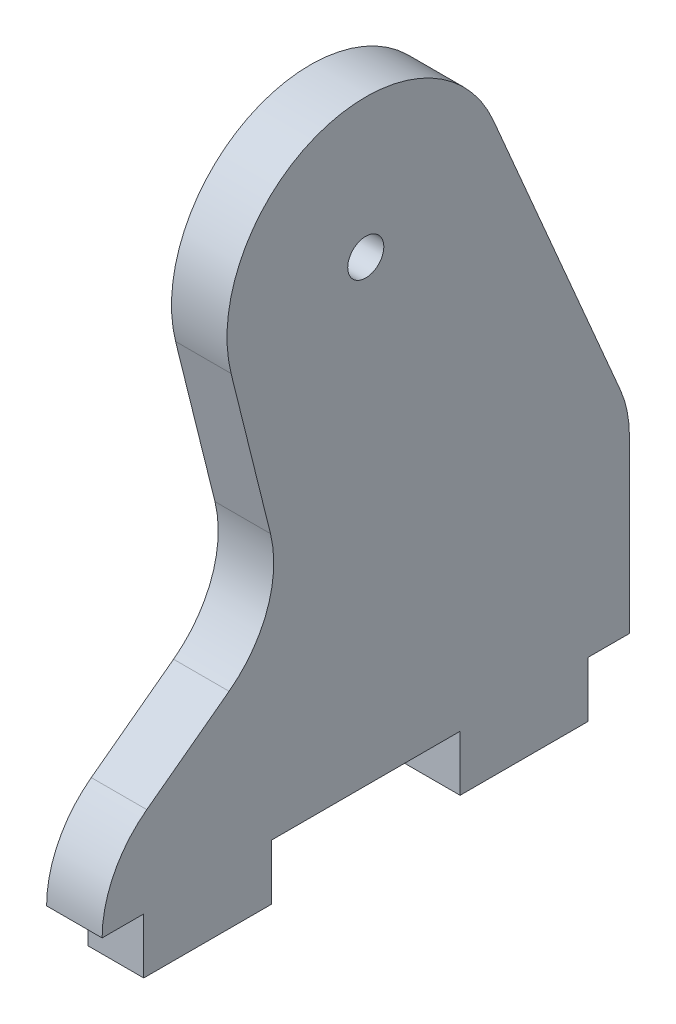
ISO-10303-21;
HEADER;
FILE_DESCRIPTION(('STEP AP214'),'2;1');
FILE_NAME('part.step','',(''),(''),'','','');
FILE_SCHEMA(('AUTOMOTIVE_DESIGN { 1 0 10303 214 1 1 1 1 }'));
ENDSEC;
DATA;
#1=APPLICATION_CONTEXT('core data for automotive mechanical design processes');
#2=APPLICATION_PROTOCOL_DEFINITION('international standard','automotive_design',2000,#1);
#3=PRODUCT_CONTEXT('',#1,'mechanical');
#4=PRODUCT('Part','Part','',(#3));
#5=PRODUCT_RELATED_PRODUCT_CATEGORY('part','',(#4));
#6=PRODUCT_DEFINITION_FORMATION('','',#4);
#7=PRODUCT_DEFINITION_CONTEXT('part definition',#1,'design');
#8=PRODUCT_DEFINITION('design','',#6,#7);
#9=PRODUCT_DEFINITION_SHAPE('','',#8);
#10=(LENGTH_UNIT() NAMED_UNIT(*) SI_UNIT(.MILLI.,.METRE.));
#11=(NAMED_UNIT(*) PLANE_ANGLE_UNIT() SI_UNIT($,.RADIAN.));
#12=(NAMED_UNIT(*) SI_UNIT($,.STERADIAN.) SOLID_ANGLE_UNIT());
#13=UNCERTAINTY_MEASURE_WITH_UNIT(LENGTH_MEASURE(1.E-05),#10,'distance_accuracy_value','');
#14=(GEOMETRIC_REPRESENTATION_CONTEXT(3) GLOBAL_UNCERTAINTY_ASSIGNED_CONTEXT((#13)) GLOBAL_UNIT_ASSIGNED_CONTEXT((#10,
#11,#12)) REPRESENTATION_CONTEXT('',''));
#15=CARTESIAN_POINT('',(0.,0.,0.));
#16=DIRECTION('',(0.,0.,1.));
#17=DIRECTION('',(1.,0.,0.));
#18=AXIS2_PLACEMENT_3D('',#15,#16,#17);
#19=CARTESIAN_POINT('',(-2.5,0.,0.));
#20=DIRECTION('',(1.,0.,0.));
#21=DIRECTION('',(0.,0.,-1.));
#22=AXIS2_PLACEMENT_3D('',#19,#20,#21);
#23=PLANE('',#22);
#24=CARTESIAN_POINT('',(-2.5,41.24,0.));
#25=DIRECTION('',(-1.,0.,0.));
#26=DIRECTION('',(0.,0.,1.));
#27=AXIS2_PLACEMENT_3D('',#24,#25,#26);
#28=CIRCLE('',#27,1.625);
#29=CARTESIAN_POINT('',(-2.5,41.24,1.625));
#30=VERTEX_POINT('',#29);
#31=EDGE_CURVE('E188',#30,#30,#28,.F.);
#32=ORIENTED_EDGE('',*,*,#31,.T.);
#33=EDGE_LOOP('',(#32));
#34=FACE_BOUND('',#33,.T.);
#35=CARTESIAN_POINT('',(-2.5,15.4510918205279,-13.75));
#36=DIRECTION('',(-1.,0.,0.));
#37=DIRECTION('',(0.,0.,1.));
#38=AXIS2_PLACEMENT_3D('',#35,#36,#37);
#39=CIRCLE('',#38,10.);
#40=CARTESIAN_POINT('',(-2.5,15.4510918205279,-23.75));
#41=VERTEX_POINT('',#40);
#42=CARTESIAN_POINT('',(-2.5,19.3838116294157,-22.9442218215998));
#43=VERTEX_POINT('',#42);
#44=EDGE_CURVE('E20',#41,#43,#39,.F.);
#45=ORIENTED_EDGE('',*,*,#44,.F.);
#46=DIRECTION('',(0.,1.,0.));
#47=VECTOR('',#46,1.);
#48=CARTESIAN_POINT('',(-2.5,0.,-23.75));
#49=LINE('',#48,#47);
#50=CARTESIAN_POINT('',(-2.5,0.,-23.75));
#51=VERTEX_POINT('',#50);
#52=EDGE_CURVE('E133',#41,#51,#49,.F.);
#53=ORIENTED_EDGE('',*,*,#52,.T.);
#54=DIRECTION('',(0.,0.,-1.));
#55=VECTOR('',#54,1.);
#56=CARTESIAN_POINT('',(-2.5,0.,0.));
#57=LINE('',#56,#55);
#58=CARTESIAN_POINT('',(-2.5,0.,-20.));
#59=VERTEX_POINT('',#58);
#60=EDGE_CURVE('E166',#59,#51,#57,.T.);
#61=ORIENTED_EDGE('',*,*,#60,.F.);
#62=DIRECTION('',(0.,1.,0.));
#63=VECTOR('',#62,1.);
#64=CARTESIAN_POINT('',(-2.5,0.,-20.));
#65=LINE('',#64,#63);
#66=CARTESIAN_POINT('',(-2.5,-5.,-20.));
#67=VERTEX_POINT('',#66);
#68=EDGE_CURVE('E182',#67,#59,#65,.T.);
#69=ORIENTED_EDGE('',*,*,#68,.F.);
#70=DIRECTION('',(0.,0.,1.));
#71=VECTOR('',#70,1.);
#72=CARTESIAN_POINT('',(-2.5,-5.,0.));
#73=LINE('',#72,#71);
#74=CARTESIAN_POINT('',(-2.5,-5.,-8.5));
#75=VERTEX_POINT('',#74);
#76=EDGE_CURVE('E184',#67,#75,#73,.T.);
#77=ORIENTED_EDGE('',*,*,#76,.T.);
#78=DIRECTION('',(0.,1.,0.));
#79=VECTOR('',#78,1.);
#80=CARTESIAN_POINT('',(-2.5,0.,-8.5));
#81=LINE('',#80,#79);
#82=CARTESIAN_POINT('',(-2.5,0.,-8.5));
#83=VERTEX_POINT('',#82);
#84=EDGE_CURVE('E201',#75,#83,#81,.T.);
#85=ORIENTED_EDGE('',*,*,#84,.T.);
#86=DIRECTION('',(0.,0.,-1.));
#87=VECTOR('',#86,1.);
#88=CARTESIAN_POINT('',(-2.5,0.,0.));
#89=LINE('',#88,#87);
#90=CARTESIAN_POINT('',(-2.5,0.,8.5));
#91=VERTEX_POINT('',#90);
#92=EDGE_CURVE('E224',#91,#83,#89,.T.);
#93=ORIENTED_EDGE('',*,*,#92,.F.);
#94=DIRECTION('',(0.,1.,0.));
#95=VECTOR('',#94,1.);
#96=CARTESIAN_POINT('',(-2.5,0.,8.5));
#97=LINE('',#96,#95);
#98=CARTESIAN_POINT('',(-2.5,-5.,8.5));
#99=VERTEX_POINT('',#98);
#100=EDGE_CURVE('E234',#99,#91,#97,.T.);
#101=ORIENTED_EDGE('',*,*,#100,.F.);
#102=DIRECTION('',(0.,0.,-1.));
#103=VECTOR('',#102,1.);
#104=CARTESIAN_POINT('',(-2.5,-5.,0.));
#105=LINE('',#104,#103);
#106=CARTESIAN_POINT('',(-2.5,-5.,20.));
#107=VERTEX_POINT('',#106);
#108=EDGE_CURVE('E244',#107,#99,#105,.T.);
#109=ORIENTED_EDGE('',*,*,#108,.F.);
#110=DIRECTION('',(0.,1.,0.));
#111=VECTOR('',#110,1.);
#112=CARTESIAN_POINT('',(-2.5,0.,20.));
#113=LINE('',#112,#111);
#114=CARTESIAN_POINT('',(-2.5,0.,20.));
#115=VERTEX_POINT('',#114);
#116=EDGE_CURVE('E247',#107,#115,#113,.T.);
#117=ORIENTED_EDGE('',*,*,#116,.T.);
#118=DIRECTION('',(0.,0.,-1.));
#119=VECTOR('',#118,1.);
#120=CARTESIAN_POINT('',(-2.5,0.,0.));
#121=LINE('',#120,#119);
#122=CARTESIAN_POINT('',(-2.5,0.,23.75));
#123=VERTEX_POINT('',#122);
#124=EDGE_CURVE('E263',#123,#115,#121,.T.);
#125=ORIENTED_EDGE('',*,*,#124,.F.);
#126=CARTESIAN_POINT('',(-2.5,-0.0189906176558735,13.7500180321942));
#127=DIRECTION('',(-1.,0.,0.));
#128=DIRECTION('',(0.,0.,1.));
#129=AXIS2_PLACEMENT_3D('',#126,#127,#128);
#130=CIRCLE('',#129,10.);
#131=CARTESIAN_POINT('',(-2.5,7.99917679182561,19.7257181077945));
#132=VERTEX_POINT('',#131);
#133=EDGE_CURVE('E266',#132,#123,#130,.F.);
#134=ORIENTED_EDGE('',*,*,#133,.F.);
#135=DIRECTION('',(0.,0.597570007560027,-0.801816740948148));
#136=VECTOR('',#135,1.);
#137=CARTESIAN_POINT('',(-2.5,14.5941642841394,10.8765936357139));
#138=LINE('',#137,#136);
#139=CARTESIAN_POINT('',(-2.5,13.5246664400314,12.311641019225));
#140=VERTEX_POINT('',#139);
#141=EDGE_CURVE('E269',#132,#140,#138,.T.);
#142=ORIENTED_EDGE('',*,*,#141,.T.);
#143=CARTESIAN_POINT('',(-2.5,21.5428338495129,18.2873410948253));
#144=DIRECTION('',(1.,0.,0.));
#145=DIRECTION('',(0.,0.,-1.));
#146=AXIS2_PLACEMENT_3D('',#143,#144,#145);
#147=CIRCLE('',#146,10.);
#148=CARTESIAN_POINT('',(-2.5,23.9559085739421,8.58285396905089));
#149=VERTEX_POINT('',#148);
#150=EDGE_CURVE('E295',#140,#149,#147,.T.);
#151=ORIENTED_EDGE('',*,*,#150,.T.);
#152=DIRECTION('',(0.,0.970448712577439,0.241307472442921));
#153=VECTOR('',#152,1.);
#154=CARTESIAN_POINT('',(-2.5,-0.614967227906445,2.47316897631627));
#155=LINE('',#154,#153);
#156=CARTESIAN_POINT('',(-2.5,38.2236565944635,12.130608907218));
#157=VERTEX_POINT('',#156);
#158=EDGE_CURVE('E274',#149,#157,#155,.T.);
#159=ORIENTED_EDGE('',*,*,#158,.T.);
#160=CARTESIAN_POINT('',(-2.5,41.24,0.));
#161=DIRECTION('',(-1.,0.,0.));
#162=DIRECTION('',(0.,0.,1.));
#163=AXIS2_PLACEMENT_3D('',#160,#161,#162);
#164=CIRCLE('',#163,12.5);
#165=CARTESIAN_POINT('',(-2.5,46.1558997611097,-11.4927772769997));
#166=VERTEX_POINT('',#165);
#167=EDGE_CURVE('E142',#166,#157,#164,.F.);
#168=ORIENTED_EDGE('',*,*,#167,.F.);
#169=DIRECTION('',(0.,-0.91942218215998,-0.393271980888775));
#170=VECTOR('',#169,1.);
#171=CARTESIAN_POINT('',(-2.5,11.2941957343776,-26.4044594897806));
#172=LINE('',#171,#170);
#173=EDGE_CURVE('E138',#166,#43,#172,.T.);
#174=ORIENTED_EDGE('',*,*,#173,.T.);
#175=EDGE_LOOP('',(#45,#53,#61,#69,#77,#85,#93,#101,#109,#117,#125,#134,#142,#151,#159,#168,#174));
#176=FACE_BOUND('',#175,.T.);
#177=ADVANCED_FACE('F17',(#34,#176),#23,.F.);
#178=CARTESIAN_POINT('',(2.5,0.,-23.75));
#179=DIRECTION('',(0.,0.,1.));
#180=DIRECTION('',(1.,0.,0.));
#181=AXIS2_PLACEMENT_3D('',#178,#179,#180);
#182=PLANE('',#181);
#183=DIRECTION('',(-1.,0.,0.));
#184=VECTOR('',#183,1.);
#185=CARTESIAN_POINT('',(2.5,15.4510918205279,-23.75));
#186=LINE('',#185,#184);
#187=CARTESIAN_POINT('',(2.5,15.4510918205279,-23.75));
#188=VERTEX_POINT('',#187);
#189=EDGE_CURVE('E152',#188,#41,#186,.T.);
#190=ORIENTED_EDGE('',*,*,#189,.F.);
#191=DIRECTION('',(0.,1.,0.));
#192=VECTOR('',#191,1.);
#193=CARTESIAN_POINT('',(2.5,0.,-23.75));
#194=LINE('',#193,#192);
#195=CARTESIAN_POINT('',(2.5,0.,-23.75));
#196=VERTEX_POINT('',#195);
#197=EDGE_CURVE('E290',#196,#188,#194,.T.);
#198=ORIENTED_EDGE('',*,*,#197,.F.);
#199=DIRECTION('',(1.,0.,0.));
#200=VECTOR('',#199,1.);
#201=CARTESIAN_POINT('',(2.5,0.,-23.75));
#202=LINE('',#201,#200);
#203=EDGE_CURVE('E163',#51,#196,#202,.T.);
#204=ORIENTED_EDGE('',*,*,#203,.F.);
#205=ORIENTED_EDGE('',*,*,#52,.F.);
#206=EDGE_LOOP('',(#190,#198,#204,#205));
#207=FACE_BOUND('',#206,.T.);
#208=ADVANCED_FACE('F347',(#207),#182,.F.);
#209=CARTESIAN_POINT('',(2.5,15.4510918205279,-13.75));
#210=DIRECTION('',(-1.,0.,0.));
#211=DIRECTION('',(0.,0.,1.));
#212=AXIS2_PLACEMENT_3D('',#209,#210,#211);
#213=CYLINDRICAL_SURFACE('',#212,10.);
#214=ORIENTED_EDGE('',*,*,#44,.T.);
#215=DIRECTION('',(1.,0.,0.));
#216=VECTOR('',#215,1.);
#217=CARTESIAN_POINT('',(2.5,19.3838116294157,-22.9442218215998));
#218=LINE('',#217,#216);
#219=CARTESIAN_POINT('',(2.5,19.3838116294157,-22.9442218215998));
#220=VERTEX_POINT('',#219);
#221=EDGE_CURVE('E146',#43,#220,#218,.T.);
#222=ORIENTED_EDGE('',*,*,#221,.T.);
#223=CARTESIAN_POINT('',(2.5,15.4510918205279,-13.75));
#224=DIRECTION('',(-1.,0.,0.));
#225=DIRECTION('',(0.,0.,1.));
#226=AXIS2_PLACEMENT_3D('',#223,#224,#225);
#227=CIRCLE('',#226,10.);
#228=EDGE_CURVE('E288',#188,#220,#227,.F.);
#229=ORIENTED_EDGE('',*,*,#228,.F.);
#230=ORIENTED_EDGE('',*,*,#189,.T.);
#231=EDGE_LOOP('',(#214,#222,#229,#230));
#232=FACE_BOUND('',#231,.T.);
#233=ADVANCED_FACE('F149',(#232),#213,.T.);
#234=CARTESIAN_POINT('',(2.5,11.2941957343776,-26.4044594897806));
#235=DIRECTION('',(0.,-0.393271980888775,0.91942218215998));
#236=DIRECTION('',(0.,-0.91942218215998,-0.393271980888775));
#237=AXIS2_PLACEMENT_3D('',#234,#235,#236);
#238=PLANE('',#237);
#239=ORIENTED_EDGE('',*,*,#221,.F.);
#240=ORIENTED_EDGE('',*,*,#173,.F.);
#241=DIRECTION('',(-1.,0.,0.));
#242=VECTOR('',#241,1.);
#243=CARTESIAN_POINT('',(2.5,46.1558997611097,-11.4927772769997));
#244=LINE('',#243,#242);
#245=CARTESIAN_POINT('',(2.5,46.1558997611097,-11.4927772769997));
#246=VERTEX_POINT('',#245);
#247=EDGE_CURVE('E157',#246,#166,#244,.T.);
#248=ORIENTED_EDGE('',*,*,#247,.F.);
#249=DIRECTION('',(0.,0.91942218215998,0.393271980888775));
#250=VECTOR('',#249,1.);
#251=CARTESIAN_POINT('',(2.5,19.3838116294157,-22.9442218215998));
#252=LINE('',#251,#250);
#253=EDGE_CURVE('E155',#220,#246,#252,.T.);
#254=ORIENTED_EDGE('',*,*,#253,.F.);
#255=EDGE_LOOP('',(#239,#240,#248,#254));
#256=FACE_BOUND('',#255,.T.);
#257=ADVANCED_FACE('F153',(#256),#238,.F.);
#258=CARTESIAN_POINT('',(2.5,41.24,0.));
#259=DIRECTION('',(-1.,0.,0.));
#260=DIRECTION('',(0.,0.,1.));
#261=AXIS2_PLACEMENT_3D('',#258,#259,#260);
#262=CYLINDRICAL_SURFACE('',#261,12.5);
#263=ORIENTED_EDGE('',*,*,#167,.T.);
#264=DIRECTION('',(1.,0.,0.));
#265=VECTOR('',#264,1.);
#266=CARTESIAN_POINT('',(2.5,38.2236565944635,12.130608907218));
#267=LINE('',#266,#265);
#268=CARTESIAN_POINT('',(2.5,38.2236565944635,12.130608907218));
#269=VERTEX_POINT('',#268);
#270=EDGE_CURVE('E276',#157,#269,#267,.T.);
#271=ORIENTED_EDGE('',*,*,#270,.T.);
#272=CARTESIAN_POINT('',(2.5,41.24,0.));
#273=DIRECTION('',(-1.,0.,0.));
#274=DIRECTION('',(0.,0.,1.));
#275=AXIS2_PLACEMENT_3D('',#272,#273,#274);
#276=CIRCLE('',#275,12.5);
#277=EDGE_CURVE('E286',#246,#269,#276,.F.);
#278=ORIENTED_EDGE('',*,*,#277,.F.);
#279=ORIENTED_EDGE('',*,*,#247,.T.);
#280=EDGE_LOOP('',(#263,#271,#278,#279));
#281=FACE_BOUND('',#280,.T.);
#282=ADVANCED_FACE('F348',(#281),#262,.T.);
#283=CARTESIAN_POINT('',(2.5,-0.614967227906445,2.47316897631627));
#284=DIRECTION('',(0.,0.241307472442921,-0.970448712577439));
#285=DIRECTION('',(0.,0.970448712577439,0.241307472442921));
#286=AXIS2_PLACEMENT_3D('',#283,#284,#285);
#287=PLANE('',#286);
#288=DIRECTION('',(1.,0.,0.));
#289=VECTOR('',#288,1.);
#290=CARTESIAN_POINT('',(2.5,23.9559085739421,8.58285396905089));
#291=LINE('',#290,#289);
#292=CARTESIAN_POINT('',(2.5,23.9559085739421,8.58285396905089));
#293=VERTEX_POINT('',#292);
#294=EDGE_CURVE('E275',#149,#293,#291,.T.);
#295=ORIENTED_EDGE('',*,*,#294,.T.);
#296=DIRECTION('',(0.,-0.970448712577439,-0.241307472442922));
#297=VECTOR('',#296,1.);
#298=CARTESIAN_POINT('',(2.5,38.2236565944635,12.130608907218));
#299=LINE('',#298,#297);
#300=EDGE_CURVE('E285',#269,#293,#299,.T.);
#301=ORIENTED_EDGE('',*,*,#300,.F.);
#302=ORIENTED_EDGE('',*,*,#270,.F.);
#303=ORIENTED_EDGE('',*,*,#158,.F.);
#304=EDGE_LOOP('',(#295,#301,#302,#303));
#305=FACE_BOUND('',#304,.T.);
#306=ADVANCED_FACE('F350',(#305),#287,.F.);
#307=CARTESIAN_POINT('',(2.5,21.5428338495129,18.2873410948253));
#308=DIRECTION('',(1.,0.,0.));
#309=DIRECTION('',(0.,0.,-1.));
#310=AXIS2_PLACEMENT_3D('',#307,#308,#309);
#311=CYLINDRICAL_SURFACE('',#310,10.);
#312=ORIENTED_EDGE('',*,*,#150,.F.);
#313=DIRECTION('',(1.,0.,0.));
#314=VECTOR('',#313,1.);
#315=CARTESIAN_POINT('',(2.5,13.5246664400314,12.311641019225));
#316=LINE('',#315,#314);
#317=CARTESIAN_POINT('',(2.5,13.5246664400314,12.311641019225));
#318=VERTEX_POINT('',#317);
#319=EDGE_CURVE('E273',#140,#318,#316,.T.);
#320=ORIENTED_EDGE('',*,*,#319,.T.);
#321=CARTESIAN_POINT('',(2.5,21.5428338495129,18.2873410948253));
#322=DIRECTION('',(1.,0.,0.));
#323=DIRECTION('',(0.,0.,-1.));
#324=AXIS2_PLACEMENT_3D('',#321,#322,#323);
#325=CIRCLE('',#324,10.);
#326=EDGE_CURVE('E283',#293,#318,#325,.F.);
#327=ORIENTED_EDGE('',*,*,#326,.F.);
#328=ORIENTED_EDGE('',*,*,#294,.F.);
#329=EDGE_LOOP('',(#312,#320,#327,#328));
#330=FACE_BOUND('',#329,.T.);
#331=ADVANCED_FACE('F357',(#330),#311,.F.);
#332=CARTESIAN_POINT('',(2.5,14.5941642841394,10.8765936357139));
#333=DIRECTION('',(0.,-0.801816740948148,-0.597570007560027));
#334=DIRECTION('',(0.,0.597570007560027,-0.801816740948148));
#335=AXIS2_PLACEMENT_3D('',#332,#333,#334);
#336=PLANE('',#335);
#337=DIRECTION('',(-1.,0.,0.));
#338=VECTOR('',#337,1.);
#339=CARTESIAN_POINT('',(2.5,7.9991767918256,19.7257181077945));
#340=LINE('',#339,#338);
#341=CARTESIAN_POINT('',(2.5,7.99917679182561,19.7257181077945));
#342=VERTEX_POINT('',#341);
#343=EDGE_CURVE('E272',#342,#132,#340,.T.);
#344=ORIENTED_EDGE('',*,*,#343,.F.);
#345=DIRECTION('',(0.,-0.597570007560027,0.801816740948148));
#346=VECTOR('',#345,1.);
#347=CARTESIAN_POINT('',(2.5,13.5246664400314,12.311641019225));
#348=LINE('',#347,#346);
#349=EDGE_CURVE('E282',#318,#342,#348,.T.);
#350=ORIENTED_EDGE('',*,*,#349,.F.);
#351=ORIENTED_EDGE('',*,*,#319,.F.);
#352=ORIENTED_EDGE('',*,*,#141,.F.);
#353=EDGE_LOOP('',(#344,#350,#351,#352));
#354=FACE_BOUND('',#353,.T.);
#355=ADVANCED_FACE('F404',(#354),#336,.F.);
#356=CARTESIAN_POINT('',(2.5,-0.0189906176558735,13.7500180321942));
#357=DIRECTION('',(-1.,0.,0.));
#358=DIRECTION('',(0.,0.,1.));
#359=AXIS2_PLACEMENT_3D('',#356,#357,#358);
#360=CYLINDRICAL_SURFACE('',#359,10.);
#361=ORIENTED_EDGE('',*,*,#133,.T.);
#362=DIRECTION('',(1.,0.,0.));
#363=VECTOR('',#362,1.);
#364=CARTESIAN_POINT('',(2.5,0.,23.75));
#365=LINE('',#364,#363);
#366=CARTESIAN_POINT('',(2.5,0.,23.75));
#367=VERTEX_POINT('',#366);
#368=EDGE_CURVE('E265',#367,#123,#365,.F.);
#369=ORIENTED_EDGE('',*,*,#368,.F.);
#370=CARTESIAN_POINT('',(2.5,-0.0189906176558735,13.7500180321942));
#371=DIRECTION('',(-1.,0.,0.));
#372=DIRECTION('',(0.,0.,1.));
#373=AXIS2_PLACEMENT_3D('',#370,#371,#372);
#374=CIRCLE('',#373,10.);
#375=EDGE_CURVE('E278',#342,#367,#374,.F.);
#376=ORIENTED_EDGE('',*,*,#375,.F.);
#377=ORIENTED_EDGE('',*,*,#343,.T.);
#378=EDGE_LOOP('',(#361,#369,#376,#377));
#379=FACE_BOUND('',#378,.T.);
#380=ADVANCED_FACE('F400',(#379),#360,.T.);
#381=CARTESIAN_POINT('',(2.5,0.,0.));
#382=DIRECTION('',(0.,-1.,0.));
#383=DIRECTION('',(0.,0.,-1.));
#384=AXIS2_PLACEMENT_3D('',#381,#382,#383);
#385=PLANE('',#384);
#386=DIRECTION('',(0.,0.,-1.));
#387=VECTOR('',#386,1.);
#388=CARTESIAN_POINT('',(2.5,0.,0.));
#389=LINE('',#388,#387);
#390=CARTESIAN_POINT('',(2.5,0.,20.));
#391=VERTEX_POINT('',#390);
#392=EDGE_CURVE('E281',#367,#391,#389,.T.);
#393=ORIENTED_EDGE('',*,*,#392,.F.);
#394=ORIENTED_EDGE('',*,*,#368,.T.);
#395=ORIENTED_EDGE('',*,*,#124,.T.);
#396=DIRECTION('',(-1.,0.,0.));
#397=VECTOR('',#396,1.);
#398=CARTESIAN_POINT('',(2.5,0.,20.));
#399=LINE('',#398,#397);
#400=EDGE_CURVE('E256',#115,#391,#399,.F.);
#401=ORIENTED_EDGE('',*,*,#400,.T.);
#402=EDGE_LOOP('',(#393,#394,#395,#401));
#403=FACE_BOUND('',#402,.T.);
#404=ADVANCED_FACE('F396',(#403),#385,.T.);
#405=CARTESIAN_POINT('',(2.5,0.,20.));
#406=DIRECTION('',(0.,0.,-1.));
#407=DIRECTION('',(-1.,0.,0.));
#408=AXIS2_PLACEMENT_3D('',#405,#406,#407);
#409=PLANE('',#408);
#410=DIRECTION('',(1.,0.,0.));
#411=VECTOR('',#410,1.);
#412=CARTESIAN_POINT('',(2.5,-5.,20.));
#413=LINE('',#412,#411);
#414=CARTESIAN_POINT('',(2.5,-5.,20.));
#415=VERTEX_POINT('',#414);
#416=EDGE_CURVE('E237',#415,#107,#413,.F.);
#417=ORIENTED_EDGE('',*,*,#416,.F.);
#418=DIRECTION('',(0.,1.,0.));
#419=VECTOR('',#418,1.);
#420=CARTESIAN_POINT('',(2.5,0.,20.));
#421=LINE('',#420,#419);
#422=EDGE_CURVE('E312',#391,#415,#421,.F.);
#423=ORIENTED_EDGE('',*,*,#422,.F.);
#424=ORIENTED_EDGE('',*,*,#400,.F.);
#425=ORIENTED_EDGE('',*,*,#116,.F.);
#426=EDGE_LOOP('',(#417,#423,#424,#425));
#427=FACE_BOUND('',#426,.T.);
#428=ADVANCED_FACE('F392',(#427),#409,.F.);
#429=CARTESIAN_POINT('',(2.5,-5.,0.));
#430=DIRECTION('',(0.,-1.,0.));
#431=DIRECTION('',(0.,0.,-1.));
#432=AXIS2_PLACEMENT_3D('',#429,#430,#431);
#433=PLANE('',#432);
#434=DIRECTION('',(0.,0.,-1.));
#435=VECTOR('',#434,1.);
#436=CARTESIAN_POINT('',(2.5,-5.,0.));
#437=LINE('',#436,#435);
#438=CARTESIAN_POINT('',(2.5,-5.,8.5));
#439=VERTEX_POINT('',#438);
#440=EDGE_CURVE('E315',#415,#439,#437,.T.);
#441=ORIENTED_EDGE('',*,*,#440,.F.);
#442=ORIENTED_EDGE('',*,*,#416,.T.);
#443=ORIENTED_EDGE('',*,*,#108,.T.);
#444=DIRECTION('',(-1.,0.,0.));
#445=VECTOR('',#444,1.);
#446=CARTESIAN_POINT('',(2.5,-5.,8.5));
#447=LINE('',#446,#445);
#448=EDGE_CURVE('E226',#439,#99,#447,.T.);
#449=ORIENTED_EDGE('',*,*,#448,.F.);
#450=EDGE_LOOP('',(#441,#442,#443,#449));
#451=FACE_BOUND('',#450,.T.);
#452=ADVANCED_FACE('F388',(#451),#433,.T.);
#453=CARTESIAN_POINT('',(2.5,0.,8.5));
#454=DIRECTION('',(0.,0.,-1.));
#455=DIRECTION('',(-1.,0.,0.));
#456=AXIS2_PLACEMENT_3D('',#453,#454,#455);
#457=PLANE('',#456);
#458=DIRECTION('',(0.,1.,0.));
#459=VECTOR('',#458,1.);
#460=CARTESIAN_POINT('',(2.5,0.,8.5));
#461=LINE('',#460,#459);
#462=CARTESIAN_POINT('',(2.5,0.,8.5));
#463=VERTEX_POINT('',#462);
#464=EDGE_CURVE('E231',#439,#463,#461,.T.);
#465=ORIENTED_EDGE('',*,*,#464,.F.);
#466=ORIENTED_EDGE('',*,*,#448,.T.);
#467=ORIENTED_EDGE('',*,*,#100,.T.);
#468=DIRECTION('',(1.,0.,0.));
#469=VECTOR('',#468,1.);
#470=CARTESIAN_POINT('',(2.5,0.,8.5));
#471=LINE('',#470,#469);
#472=EDGE_CURVE('E221',#463,#91,#471,.F.);
#473=ORIENTED_EDGE('',*,*,#472,.F.);
#474=EDGE_LOOP('',(#465,#466,#467,#473));
#475=FACE_BOUND('',#474,.T.);
#476=ADVANCED_FACE('F384',(#475),#457,.T.);
#477=CARTESIAN_POINT('',(2.5,0.,0.));
#478=DIRECTION('',(0.,-1.,0.));
#479=DIRECTION('',(0.,0.,-1.));
#480=AXIS2_PLACEMENT_3D('',#477,#478,#479);
#481=PLANE('',#480);
#482=DIRECTION('',(0.,0.,-1.));
#483=VECTOR('',#482,1.);
#484=CARTESIAN_POINT('',(2.5,0.,0.));
#485=LINE('',#484,#483);
#486=CARTESIAN_POINT('',(2.5,0.,-8.5));
#487=VERTEX_POINT('',#486);
#488=EDGE_CURVE('E217',#463,#487,#485,.T.);
#489=ORIENTED_EDGE('',*,*,#488,.F.);
#490=ORIENTED_EDGE('',*,*,#472,.T.);
#491=ORIENTED_EDGE('',*,*,#92,.T.);
#492=DIRECTION('',(-1.,0.,0.));
#493=VECTOR('',#492,1.);
#494=CARTESIAN_POINT('',(2.5,0.,-8.5));
#495=LINE('',#494,#493);
#496=EDGE_CURVE('E206',#83,#487,#495,.F.);
#497=ORIENTED_EDGE('',*,*,#496,.T.);
#498=EDGE_LOOP('',(#489,#490,#491,#497));
#499=FACE_BOUND('',#498,.T.);
#500=ADVANCED_FACE('F380',(#499),#481,.T.);
#501=CARTESIAN_POINT('',(2.5,0.,-8.5));
#502=DIRECTION('',(0.,0.,-1.));
#503=DIRECTION('',(-1.,0.,0.));
#504=AXIS2_PLACEMENT_3D('',#501,#502,#503);
#505=PLANE('',#504);
#506=DIRECTION('',(1.,0.,0.));
#507=VECTOR('',#506,1.);
#508=CARTESIAN_POINT('',(2.5,-5.,-8.5));
#509=LINE('',#508,#507);
#510=CARTESIAN_POINT('',(2.5,-5.,-8.5));
#511=VERTEX_POINT('',#510);
#512=EDGE_CURVE('E193',#75,#511,#509,.T.);
#513=ORIENTED_EDGE('',*,*,#512,.T.);
#514=DIRECTION('',(0.,1.,0.));
#515=VECTOR('',#514,1.);
#516=CARTESIAN_POINT('',(2.5,0.,-8.5));
#517=LINE('',#516,#515);
#518=EDGE_CURVE('E212',#487,#511,#517,.F.);
#519=ORIENTED_EDGE('',*,*,#518,.F.);
#520=ORIENTED_EDGE('',*,*,#496,.F.);
#521=ORIENTED_EDGE('',*,*,#84,.F.);
#522=EDGE_LOOP('',(#513,#519,#520,#521));
#523=FACE_BOUND('',#522,.T.);
#524=ADVANCED_FACE('F377',(#523),#505,.F.);
#525=CARTESIAN_POINT('',(2.5,-5.,0.));
#526=DIRECTION('',(0.,1.,0.));
#527=DIRECTION('',(0.,0.,1.));
#528=AXIS2_PLACEMENT_3D('',#525,#526,#527);
#529=PLANE('',#528);
#530=DIRECTION('',(-1.,0.,0.));
#531=VECTOR('',#530,1.);
#532=CARTESIAN_POINT('',(2.5,-5.,-20.));
#533=LINE('',#532,#531);
#534=CARTESIAN_POINT('',(2.5,-5.,-20.));
#535=VERTEX_POINT('',#534);
#536=EDGE_CURVE('E179',#535,#67,#533,.T.);
#537=ORIENTED_EDGE('',*,*,#536,.F.);
#538=DIRECTION('',(0.,0.,-1.));
#539=VECTOR('',#538,1.);
#540=CARTESIAN_POINT('',(2.5,-5.,0.));
#541=LINE('',#540,#539);
#542=EDGE_CURVE('E209',#511,#535,#541,.T.);
#543=ORIENTED_EDGE('',*,*,#542,.F.);
#544=ORIENTED_EDGE('',*,*,#512,.F.);
#545=ORIENTED_EDGE('',*,*,#76,.F.);
#546=EDGE_LOOP('',(#537,#543,#544,#545));
#547=FACE_BOUND('',#546,.T.);
#548=ADVANCED_FACE('F342',(#547),#529,.F.);
#549=CARTESIAN_POINT('',(2.5,0.,-20.));
#550=DIRECTION('',(0.,0.,-1.));
#551=DIRECTION('',(-1.,0.,0.));
#552=AXIS2_PLACEMENT_3D('',#549,#550,#551);
#553=PLANE('',#552);
#554=DIRECTION('',(0.,1.,0.));
#555=VECTOR('',#554,1.);
#556=CARTESIAN_POINT('',(2.5,0.,-20.));
#557=LINE('',#556,#555);
#558=CARTESIAN_POINT('',(2.5,0.,-20.));
#559=VERTEX_POINT('',#558);
#560=EDGE_CURVE('E171',#535,#559,#557,.T.);
#561=ORIENTED_EDGE('',*,*,#560,.F.);
#562=ORIENTED_EDGE('',*,*,#536,.T.);
#563=ORIENTED_EDGE('',*,*,#68,.T.);
#564=DIRECTION('',(1.,0.,0.));
#565=VECTOR('',#564,1.);
#566=CARTESIAN_POINT('',(2.5,0.,-20.));
#567=LINE('',#566,#565);
#568=EDGE_CURVE('E35',#559,#59,#567,.F.);
#569=ORIENTED_EDGE('',*,*,#568,.F.);
#570=EDGE_LOOP('',(#561,#562,#563,#569));
#571=FACE_BOUND('',#570,.T.);
#572=ADVANCED_FACE('F339',(#571),#553,.T.);
#573=CARTESIAN_POINT('',(2.5,0.,0.));
#574=DIRECTION('',(0.,-1.,0.));
#575=DIRECTION('',(0.,0.,-1.));
#576=AXIS2_PLACEMENT_3D('',#573,#574,#575);
#577=PLANE('',#576);
#578=DIRECTION('',(0.,0.,-1.));
#579=VECTOR('',#578,1.);
#580=CARTESIAN_POINT('',(2.5,0.,0.));
#581=LINE('',#580,#579);
#582=EDGE_CURVE('E26',#559,#196,#581,.T.);
#583=ORIENTED_EDGE('',*,*,#582,.F.);
#584=ORIENTED_EDGE('',*,*,#568,.T.);
#585=ORIENTED_EDGE('',*,*,#60,.T.);
#586=ORIENTED_EDGE('',*,*,#203,.T.);
#587=EDGE_LOOP('',(#583,#584,#585,#586));
#588=FACE_BOUND('',#587,.T.);
#589=ADVANCED_FACE('F346',(#588),#577,.T.);
#590=CARTESIAN_POINT('',(2.5,41.24,0.));
#591=DIRECTION('',(-1.,0.,0.));
#592=DIRECTION('',(0.,0.,1.));
#593=AXIS2_PLACEMENT_3D('',#590,#591,#592);
#594=CYLINDRICAL_SURFACE('',#593,1.625);
#595=CARTESIAN_POINT('',(2.5,41.24,0.));
#596=DIRECTION('',(-1.,0.,0.));
#597=DIRECTION('',(0.,0.,1.));
#598=AXIS2_PLACEMENT_3D('',#595,#596,#597);
#599=CIRCLE('',#598,1.625);
#600=CARTESIAN_POINT('',(2.5,41.24,1.625));
#601=VERTEX_POINT('',#600);
#602=EDGE_CURVE('E11',#601,#601,#599,.T.);
#603=ORIENTED_EDGE('',*,*,#602,.F.);
#604=EDGE_LOOP('',(#603));
#605=FACE_BOUND('',#604,.T.);
#606=ORIENTED_EDGE('',*,*,#31,.F.);
#607=EDGE_LOOP('',(#606));
#608=FACE_BOUND('',#607,.T.);
#609=ADVANCED_FACE('F362',(#605,#608),#594,.F.);
#610=CARTESIAN_POINT('',(2.5,0.,0.));
#611=DIRECTION('',(1.,0.,0.));
#612=DIRECTION('',(0.,0.,-1.));
#613=AXIS2_PLACEMENT_3D('',#610,#611,#612);
#614=PLANE('',#613);
#615=ORIENTED_EDGE('',*,*,#602,.T.);
#616=EDGE_LOOP('',(#615));
#617=FACE_BOUND('',#616,.T.);
#618=ORIENTED_EDGE('',*,*,#560,.T.);
#619=ORIENTED_EDGE('',*,*,#582,.T.);
#620=ORIENTED_EDGE('',*,*,#197,.T.);
#621=ORIENTED_EDGE('',*,*,#228,.T.);
#622=ORIENTED_EDGE('',*,*,#253,.T.);
#623=ORIENTED_EDGE('',*,*,#277,.T.);
#624=ORIENTED_EDGE('',*,*,#300,.T.);
#625=ORIENTED_EDGE('',*,*,#326,.T.);
#626=ORIENTED_EDGE('',*,*,#349,.T.);
#627=ORIENTED_EDGE('',*,*,#375,.T.);
#628=ORIENTED_EDGE('',*,*,#392,.T.);
#629=ORIENTED_EDGE('',*,*,#422,.T.);
#630=ORIENTED_EDGE('',*,*,#440,.T.);
#631=ORIENTED_EDGE('',*,*,#464,.T.);
#632=ORIENTED_EDGE('',*,*,#488,.T.);
#633=ORIENTED_EDGE('',*,*,#518,.T.);
#634=ORIENTED_EDGE('',*,*,#542,.T.);
#635=EDGE_LOOP('',(#618,#619,#620,#621,#622,#623,#624,#625,#626,#627,#628,#629,#630,#631,#632,
#633,#634));
#636=FACE_BOUND('',#635,.T.);
#637=ADVANCED_FACE('F337',(#617,#636),#614,.T.);
#638=CLOSED_SHELL('',(#177,#208,#233,#257,#282,#306,#331,#355,#380,#404,#428,#452,#476,#500,
#524,#548,#572,#589,#609,#637));
#639=MANIFOLD_SOLID_BREP('B1',#638);
#640=ADVANCED_BREP_SHAPE_REPRESENTATION('',(#18,#639),#14);
#641=SHAPE_DEFINITION_REPRESENTATION(#9,#640);
ENDSEC;
END-ISO-10303-21;
